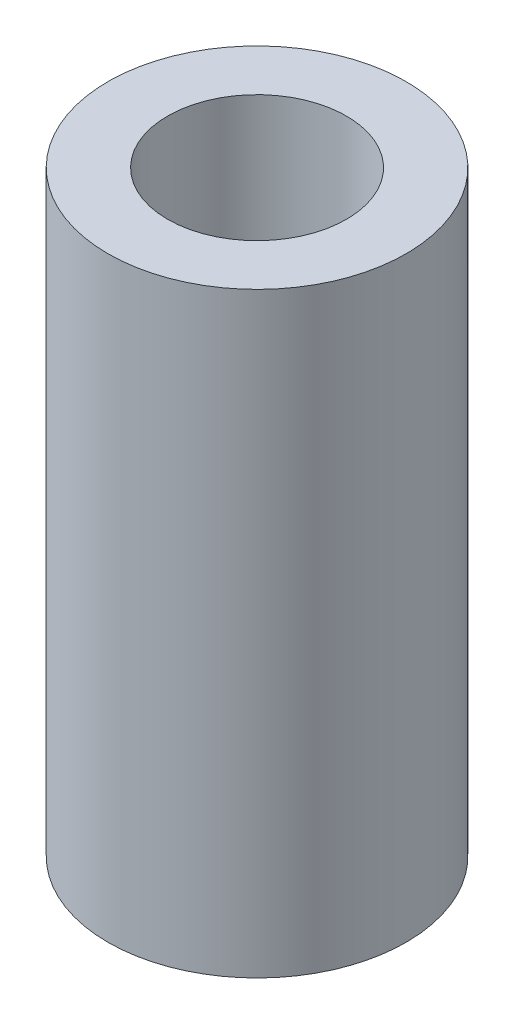
ISO-10303-21;
HEADER;
FILE_DESCRIPTION(('STEP AP214'),'2;1');
FILE_NAME('part.step','',(''),(''),'','','');
FILE_SCHEMA(('AUTOMOTIVE_DESIGN { 1 0 10303 214 1 1 1 1 }'));
ENDSEC;
DATA;
#1=APPLICATION_CONTEXT('core data for automotive mechanical design processes');
#2=APPLICATION_PROTOCOL_DEFINITION('international standard','automotive_design',2000,#1);
#3=PRODUCT_CONTEXT('',#1,'mechanical');
#4=PRODUCT('Part','Part','',(#3));
#5=PRODUCT_RELATED_PRODUCT_CATEGORY('part','',(#4));
#6=PRODUCT_DEFINITION_FORMATION('','',#4);
#7=PRODUCT_DEFINITION_CONTEXT('part definition',#1,'design');
#8=PRODUCT_DEFINITION('design','',#6,#7);
#9=PRODUCT_DEFINITION_SHAPE('','',#8);
#10=(LENGTH_UNIT() NAMED_UNIT(*) SI_UNIT(.MILLI.,.METRE.));
#11=(NAMED_UNIT(*) PLANE_ANGLE_UNIT() SI_UNIT($,.RADIAN.));
#12=(NAMED_UNIT(*) SI_UNIT($,.STERADIAN.) SOLID_ANGLE_UNIT());
#13=UNCERTAINTY_MEASURE_WITH_UNIT(LENGTH_MEASURE(1.E-05),#10,'distance_accuracy_value','');
#14=(GEOMETRIC_REPRESENTATION_CONTEXT(3) GLOBAL_UNCERTAINTY_ASSIGNED_CONTEXT((#13)) GLOBAL_UNIT_ASSIGNED_CONTEXT((#10,
#11,#12)) REPRESENTATION_CONTEXT('',''));
#15=CARTESIAN_POINT('',(0.,0.,0.));
#16=DIRECTION('',(0.,0.,1.));
#17=DIRECTION('',(1.,0.,0.));
#18=AXIS2_PLACEMENT_3D('',#15,#16,#17);
#19=CARTESIAN_POINT('',(0.,0.,0.));
#20=DIRECTION('',(0.,1.,0.));
#21=DIRECTION('',(0.,0.,1.));
#22=AXIS2_PLACEMENT_3D('',#19,#20,#21);
#23=PLANE('',#22);
#24=CARTESIAN_POINT('',(0.,0.,0.));
#25=DIRECTION('',(0.,1.,0.));
#26=DIRECTION('',(0.,0.,1.));
#27=AXIS2_PLACEMENT_3D('',#24,#25,#26);
#28=CIRCLE('',#27,1.);
#29=CARTESIAN_POINT('',(0.,0.,1.));
#30=VERTEX_POINT('',#29);
#31=EDGE_CURVE('E11',#30,#30,#28,.T.);
#32=ORIENTED_EDGE('',*,*,#31,.F.);
#33=EDGE_LOOP('',(#32));
#34=FACE_BOUND('',#33,.T.);
#35=CARTESIAN_POINT('',(0.,0.,0.));
#36=DIRECTION('',(0.,1.,0.));
#37=DIRECTION('',(0.,0.,1.));
#38=AXIS2_PLACEMENT_3D('',#35,#36,#37);
#39=CIRCLE('',#38,0.5);
#40=CARTESIAN_POINT('',(0.,0.,0.5));
#41=VERTEX_POINT('',#40);
#42=EDGE_CURVE('E43',#41,#41,#39,.T.);
#43=ORIENTED_EDGE('',*,*,#42,.T.);
#44=EDGE_LOOP('',(#43));
#45=FACE_BOUND('',#44,.T.);
#46=ADVANCED_FACE('F36',(#34,#45),#23,.F.);
#47=CARTESIAN_POINT('',(0.,1.,0.));
#48=DIRECTION('',(0.,-1.,0.));
#49=DIRECTION('',(0.,0.,-1.));
#50=AXIS2_PLACEMENT_3D('',#47,#48,#49);
#51=CYLINDRICAL_SURFACE('',#50,1.);
#52=ORIENTED_EDGE('',*,*,#31,.T.);
#53=EDGE_LOOP('',(#52));
#54=FACE_BOUND('',#53,.T.);
#55=CARTESIAN_POINT('',(0.,4.,0.));
#56=DIRECTION('',(0.,1.,0.));
#57=DIRECTION('',(0.,0.,1.));
#58=AXIS2_PLACEMENT_3D('',#55,#56,#57);
#59=CIRCLE('',#58,1.);
#60=CARTESIAN_POINT('',(0.,4.,1.));
#61=VERTEX_POINT('',#60);
#62=EDGE_CURVE('E56',#61,#61,#59,.T.);
#63=ORIENTED_EDGE('',*,*,#62,.F.);
#64=EDGE_LOOP('',(#63));
#65=FACE_BOUND('',#64,.T.);
#66=ADVANCED_FACE('F38',(#54,#65),#51,.T.);
#67=CARTESIAN_POINT('',(0.,1.,0.));
#68=DIRECTION('',(0.,-1.,0.));
#69=DIRECTION('',(0.,0.,-1.));
#70=AXIS2_PLACEMENT_3D('',#67,#68,#69);
#71=CYLINDRICAL_SURFACE('',#70,0.5);
#72=CARTESIAN_POINT('',(0.,1.,0.));
#73=DIRECTION('',(0.,1.,0.));
#74=DIRECTION('',(0.,0.,1.));
#75=AXIS2_PLACEMENT_3D('',#72,#73,#74);
#76=CIRCLE('',#75,0.5);
#77=CARTESIAN_POINT('',(0.,1.,0.5));
#78=VERTEX_POINT('',#77);
#79=EDGE_CURVE('E60',#78,#78,#76,.T.);
#80=ORIENTED_EDGE('',*,*,#79,.T.);
#81=EDGE_LOOP('',(#80));
#82=FACE_BOUND('',#81,.T.);
#83=ORIENTED_EDGE('',*,*,#42,.F.);
#84=EDGE_LOOP('',(#83));
#85=FACE_BOUND('',#84,.T.);
#86=ADVANCED_FACE('F70',(#82,#85),#71,.F.);
#87=CARTESIAN_POINT('',(0.,1.,0.));
#88=DIRECTION('',(0.,1.,0.));
#89=DIRECTION('',(0.,0.,1.));
#90=AXIS2_PLACEMENT_3D('',#87,#88,#89);
#91=PLANE('',#90);
#92=ORIENTED_EDGE('',*,*,#79,.F.);
#93=EDGE_LOOP('',(#92));
#94=FACE_BOUND('',#93,.T.);
#95=ADVANCED_FACE('F72',(#94),#91,.F.);
#96=CARTESIAN_POINT('',(0.,4.,0.));
#97=DIRECTION('',(0.,1.,0.));
#98=DIRECTION('',(0.,0.,1.));
#99=AXIS2_PLACEMENT_3D('',#96,#97,#98);
#100=PLANE('',#99);
#101=CARTESIAN_POINT('',(0.,4.,0.));
#102=DIRECTION('',(0.,1.,0.));
#103=DIRECTION('',(0.,0.,1.));
#104=AXIS2_PLACEMENT_3D('',#101,#102,#103);
#105=CIRCLE('',#104,0.599999999999989);
#106=CARTESIAN_POINT('',(0.,4.,0.599999999999989));
#107=VERTEX_POINT('',#106);
#108=EDGE_CURVE('E57',#107,#107,#105,.T.);
#109=ORIENTED_EDGE('',*,*,#108,.F.);
#110=EDGE_LOOP('',(#109));
#111=FACE_BOUND('',#110,.T.);
#112=ORIENTED_EDGE('',*,*,#62,.T.);
#113=EDGE_LOOP('',(#112));
#114=FACE_BOUND('',#113,.T.);
#115=ADVANCED_FACE('F50',(#111,#114),#100,.T.);
#116=CARTESIAN_POINT('',(0.,2.,0.));
#117=DIRECTION('',(0.,1.,0.));
#118=DIRECTION('',(0.,0.,1.));
#119=AXIS2_PLACEMENT_3D('',#116,#117,#118);
#120=CONICAL_SURFACE('',#119,0.599999999999999,1.02974425867665);
#121=CARTESIAN_POINT('',(0.,1.63948362858346,0.));
#122=VERTEX_POINT('',#121);
#123=VERTEX_LOOP('',#122);
#124=FACE_BOUND('',#123,.T.);
#125=CARTESIAN_POINT('',(0.,2.,0.));
#126=DIRECTION('',(0.,1.,0.));
#127=DIRECTION('',(0.,0.,1.));
#128=AXIS2_PLACEMENT_3D('',#125,#126,#127);
#129=CIRCLE('',#128,0.599999999999999);
#130=CARTESIAN_POINT('',(0.,2.,0.599999999999999));
#131=VERTEX_POINT('',#130);
#132=EDGE_CURVE('E54',#131,#131,#129,.T.);
#133=ORIENTED_EDGE('',*,*,#132,.T.);
#134=EDGE_LOOP('',(#133));
#135=FACE_BOUND('',#134,.T.);
#136=ADVANCED_FACE('F46',(#124,#135),#120,.F.);
#137=CARTESIAN_POINT('',(0.,4.,0.));
#138=DIRECTION('',(0.,1.,0.));
#139=DIRECTION('',(0.,0.,1.));
#140=AXIS2_PLACEMENT_3D('',#137,#138,#139);
#141=CYLINDRICAL_SURFACE('',#140,0.599999999999994);
#142=ORIENTED_EDGE('',*,*,#132,.F.);
#143=EDGE_LOOP('',(#142));
#144=FACE_BOUND('',#143,.T.);
#145=ORIENTED_EDGE('',*,*,#108,.T.);
#146=EDGE_LOOP('',(#145));
#147=FACE_BOUND('',#146,.T.);
#148=ADVANCED_FACE('F49',(#144,#147),#141,.F.);
#149=CLOSED_SHELL('',(#46,#66,#86,#95,#115,#136,#148));
#150=MANIFOLD_SOLID_BREP('B2',#149);
#151=ADVANCED_BREP_SHAPE_REPRESENTATION('',(#18,#150),#14);
#152=SHAPE_DEFINITION_REPRESENTATION(#9,#151);
ENDSEC;
END-ISO-10303-21;
